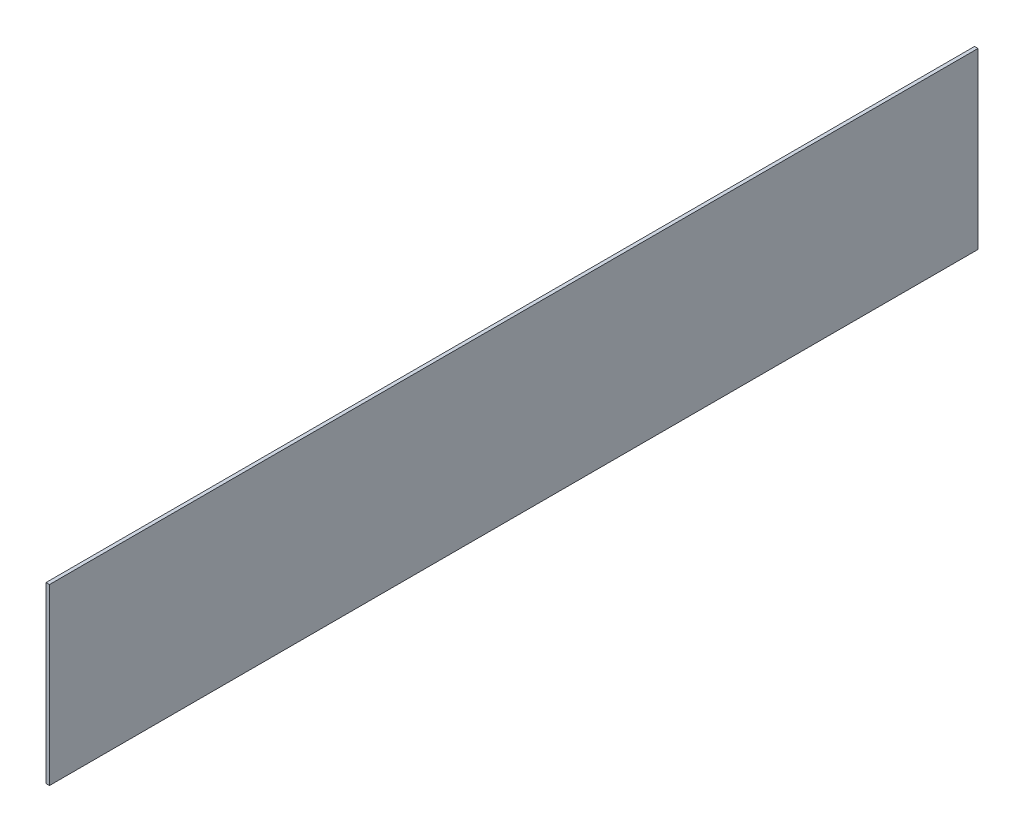
ISO-10303-21;
HEADER;
FILE_DESCRIPTION(('STEP AP214'),'2;1');
FILE_NAME('part.step','',(''),(''),'','','');
FILE_SCHEMA(('AUTOMOTIVE_DESIGN { 1 0 10303 214 1 1 1 1 }'));
ENDSEC;
DATA;
#1=APPLICATION_CONTEXT('core data for automotive mechanical design processes');
#2=APPLICATION_PROTOCOL_DEFINITION('international standard','automotive_design',2000,#1);
#3=PRODUCT_CONTEXT('',#1,'mechanical');
#4=PRODUCT('Part','Part','',(#3));
#5=PRODUCT_RELATED_PRODUCT_CATEGORY('part','',(#4));
#6=PRODUCT_DEFINITION_FORMATION('','',#4);
#7=PRODUCT_DEFINITION_CONTEXT('part definition',#1,'design');
#8=PRODUCT_DEFINITION('design','',#6,#7);
#9=PRODUCT_DEFINITION_SHAPE('','',#8);
#10=(LENGTH_UNIT() NAMED_UNIT(*) SI_UNIT(.MILLI.,.METRE.));
#11=(NAMED_UNIT(*) PLANE_ANGLE_UNIT() SI_UNIT($,.RADIAN.));
#12=(NAMED_UNIT(*) SI_UNIT($,.STERADIAN.) SOLID_ANGLE_UNIT());
#13=UNCERTAINTY_MEASURE_WITH_UNIT(LENGTH_MEASURE(1.E-05),#10,'distance_accuracy_value','');
#14=(GEOMETRIC_REPRESENTATION_CONTEXT(3) GLOBAL_UNCERTAINTY_ASSIGNED_CONTEXT((#13)) GLOBAL_UNIT_ASSIGNED_CONTEXT((#10,
#11,#12)) REPRESENTATION_CONTEXT('',''));
#15=CARTESIAN_POINT('',(0.,0.,0.));
#16=DIRECTION('',(0.,0.,1.));
#17=DIRECTION('',(1.,0.,0.));
#18=AXIS2_PLACEMENT_3D('',#15,#16,#17);
#19=CARTESIAN_POINT('',(3.,75.,-400.));
#20=DIRECTION('',(0.,0.,1.));
#21=DIRECTION('',(1.,0.,0.));
#22=AXIS2_PLACEMENT_3D('',#19,#20,#21);
#23=PLANE('',#22);
#24=DIRECTION('',(0.,1.,0.));
#25=VECTOR('',#24,1.);
#26=CARTESIAN_POINT('',(0.,75.,-400.));
#27=LINE('',#26,#25);
#28=CARTESIAN_POINT('',(0.,-75.,-400.));
#29=VERTEX_POINT('',#28);
#30=CARTESIAN_POINT('',(0.,75.,-400.));
#31=VERTEX_POINT('',#30);
#32=EDGE_CURVE('E96',#29,#31,#27,.T.);
#33=ORIENTED_EDGE('',*,*,#32,.T.);
#34=DIRECTION('',(-1.,0.,0.));
#35=VECTOR('',#34,1.);
#36=CARTESIAN_POINT('',(3.,75.,-400.));
#37=LINE('',#36,#35);
#38=CARTESIAN_POINT('',(3.,75.,-400.));
#39=VERTEX_POINT('',#38);
#40=EDGE_CURVE('E11',#39,#31,#37,.T.);
#41=ORIENTED_EDGE('',*,*,#40,.F.);
#42=DIRECTION('',(0.,1.,0.));
#43=VECTOR('',#42,1.);
#44=CARTESIAN_POINT('',(3.,75.,-400.));
#45=LINE('',#44,#43);
#46=CARTESIAN_POINT('',(3.,-75.,-400.));
#47=VERTEX_POINT('',#46);
#48=EDGE_CURVE('E84',#47,#39,#45,.T.);
#49=ORIENTED_EDGE('',*,*,#48,.F.);
#50=DIRECTION('',(-1.,0.,0.));
#51=VECTOR('',#50,1.);
#52=CARTESIAN_POINT('',(3.,-75.,-400.));
#53=LINE('',#52,#51);
#54=EDGE_CURVE('E92',#47,#29,#53,.T.);
#55=ORIENTED_EDGE('',*,*,#54,.T.);
#56=EDGE_LOOP('',(#33,#41,#49,#55));
#57=FACE_BOUND('',#56,.T.);
#58=ADVANCED_FACE('F33',(#57),#23,.F.);
#59=CARTESIAN_POINT('',(3.,75.,400.));
#60=DIRECTION('',(0.,-1.,0.));
#61=DIRECTION('',(0.,0.,-1.));
#62=AXIS2_PLACEMENT_3D('',#59,#60,#61);
#63=PLANE('',#62);
#64=DIRECTION('',(0.,0.,1.));
#65=VECTOR('',#64,1.);
#66=CARTESIAN_POINT('',(0.,75.,400.));
#67=LINE('',#66,#65);
#68=CARTESIAN_POINT('',(0.,75.,400.));
#69=VERTEX_POINT('',#68);
#70=EDGE_CURVE('E88',#31,#69,#67,.T.);
#71=ORIENTED_EDGE('',*,*,#70,.T.);
#72=DIRECTION('',(-1.,0.,0.));
#73=VECTOR('',#72,1.);
#74=CARTESIAN_POINT('',(3.,75.,400.));
#75=LINE('',#74,#73);
#76=CARTESIAN_POINT('',(3.,75.,400.));
#77=VERTEX_POINT('',#76);
#78=EDGE_CURVE('E41',#77,#69,#75,.T.);
#79=ORIENTED_EDGE('',*,*,#78,.F.);
#80=DIRECTION('',(0.,0.,1.));
#81=VECTOR('',#80,1.);
#82=CARTESIAN_POINT('',(3.,75.,400.));
#83=LINE('',#82,#81);
#84=EDGE_CURVE('E79',#39,#77,#83,.T.);
#85=ORIENTED_EDGE('',*,*,#84,.F.);
#86=ORIENTED_EDGE('',*,*,#40,.T.);
#87=EDGE_LOOP('',(#71,#79,#85,#86));
#88=FACE_BOUND('',#87,.T.);
#89=ADVANCED_FACE('F87',(#88),#63,.F.);
#90=CARTESIAN_POINT('',(3.,75.,400.));
#91=DIRECTION('',(0.,0.,-1.));
#92=DIRECTION('',(-1.,0.,0.));
#93=AXIS2_PLACEMENT_3D('',#90,#91,#92);
#94=PLANE('',#93);
#95=DIRECTION('',(0.,-1.,0.));
#96=VECTOR('',#95,1.);
#97=CARTESIAN_POINT('',(0.,75.,400.));
#98=LINE('',#97,#96);
#99=CARTESIAN_POINT('',(0.,-75.,400.));
#100=VERTEX_POINT('',#99);
#101=EDGE_CURVE('E66',#69,#100,#98,.T.);
#102=ORIENTED_EDGE('',*,*,#101,.T.);
#103=DIRECTION('',(-1.,0.,0.));
#104=VECTOR('',#103,1.);
#105=CARTESIAN_POINT('',(3.,-75.,400.));
#106=LINE('',#105,#104);
#107=CARTESIAN_POINT('',(3.,-75.,400.));
#108=VERTEX_POINT('',#107);
#109=EDGE_CURVE('E89',#108,#100,#106,.T.);
#110=ORIENTED_EDGE('',*,*,#109,.F.);
#111=DIRECTION('',(0.,-1.,0.));
#112=VECTOR('',#111,1.);
#113=CARTESIAN_POINT('',(3.,75.,400.));
#114=LINE('',#113,#112);
#115=EDGE_CURVE('E82',#77,#108,#114,.T.);
#116=ORIENTED_EDGE('',*,*,#115,.F.);
#117=ORIENTED_EDGE('',*,*,#78,.T.);
#118=EDGE_LOOP('',(#102,#110,#116,#117));
#119=FACE_BOUND('',#118,.T.);
#120=ADVANCED_FACE('F90',(#119),#94,.F.);
#121=CARTESIAN_POINT('',(3.,-75.,400.));
#122=DIRECTION('',(0.,1.,0.));
#123=DIRECTION('',(0.,0.,1.));
#124=AXIS2_PLACEMENT_3D('',#121,#122,#123);
#125=PLANE('',#124);
#126=DIRECTION('',(0.,0.,-1.));
#127=VECTOR('',#126,1.);
#128=CARTESIAN_POINT('',(0.,-75.,400.));
#129=LINE('',#128,#127);
#130=EDGE_CURVE('E72',#100,#29,#129,.T.);
#131=ORIENTED_EDGE('',*,*,#130,.T.);
#132=ORIENTED_EDGE('',*,*,#54,.F.);
#133=DIRECTION('',(0.,0.,-1.));
#134=VECTOR('',#133,1.);
#135=CARTESIAN_POINT('',(3.,-75.,400.));
#136=LINE('',#135,#134);
#137=EDGE_CURVE('E49',#108,#47,#136,.T.);
#138=ORIENTED_EDGE('',*,*,#137,.F.);
#139=ORIENTED_EDGE('',*,*,#109,.T.);
#140=EDGE_LOOP('',(#131,#132,#138,#139));
#141=FACE_BOUND('',#140,.T.);
#142=ADVANCED_FACE('F103',(#141),#125,.F.);
#143=CARTESIAN_POINT('',(3.,0.,0.));
#144=DIRECTION('',(1.,0.,0.));
#145=DIRECTION('',(0.,0.,-1.));
#146=AXIS2_PLACEMENT_3D('',#143,#144,#145);
#147=PLANE('',#146);
#148=ORIENTED_EDGE('',*,*,#48,.T.);
#149=ORIENTED_EDGE('',*,*,#84,.T.);
#150=ORIENTED_EDGE('',*,*,#115,.T.);
#151=ORIENTED_EDGE('',*,*,#137,.T.);
#152=EDGE_LOOP('',(#148,#149,#150,#151));
#153=FACE_BOUND('',#152,.T.);
#154=ADVANCED_FACE('F80',(#153),#147,.T.);
#155=CARTESIAN_POINT('',(0.,0.,0.));
#156=DIRECTION('',(1.,0.,0.));
#157=DIRECTION('',(0.,0.,-1.));
#158=AXIS2_PLACEMENT_3D('',#155,#156,#157);
#159=PLANE('',#158);
#160=ORIENTED_EDGE('',*,*,#32,.F.);
#161=ORIENTED_EDGE('',*,*,#130,.F.);
#162=ORIENTED_EDGE('',*,*,#101,.F.);
#163=ORIENTED_EDGE('',*,*,#70,.F.);
#164=EDGE_LOOP('',(#160,#161,#162,#163));
#165=FACE_BOUND('',#164,.T.);
#166=ADVANCED_FACE('F106',(#165),#159,.F.);
#167=CLOSED_SHELL('',(#58,#89,#120,#142,#154,#166));
#168=MANIFOLD_SOLID_BREP('B2',#167);
#169=ADVANCED_BREP_SHAPE_REPRESENTATION('',(#18,#168),#14);
#170=SHAPE_DEFINITION_REPRESENTATION(#9,#169);
ENDSEC;
END-ISO-10303-21;
